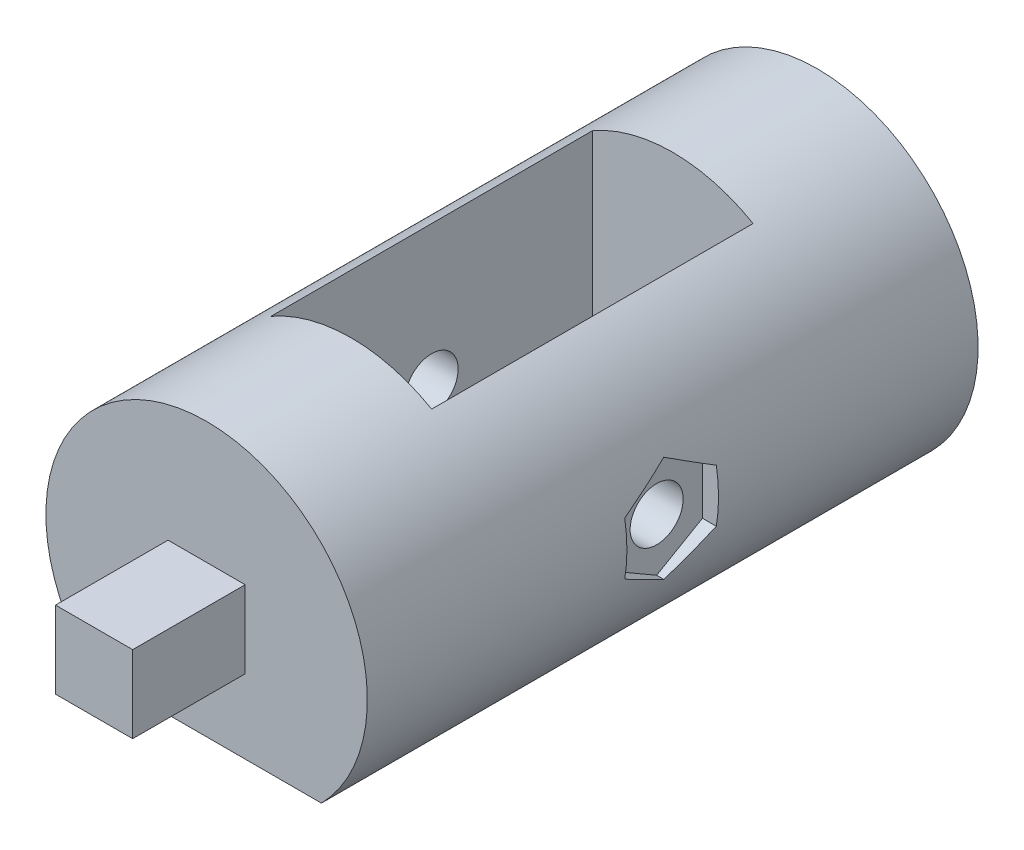
ISO-10303-21;
HEADER;
FILE_DESCRIPTION(('STEP AP214'),'2;1');
FILE_NAME('part.step','',(''),(''),'','','');
FILE_SCHEMA(('AUTOMOTIVE_DESIGN { 1 0 10303 214 1 1 1 1 }'));
ENDSEC;
DATA;
#1=APPLICATION_CONTEXT('core data for automotive mechanical design processes');
#2=APPLICATION_PROTOCOL_DEFINITION('international standard','automotive_design',2000,#1);
#3=PRODUCT_CONTEXT('',#1,'mechanical');
#4=PRODUCT('Part','Part','',(#3));
#5=PRODUCT_RELATED_PRODUCT_CATEGORY('part','',(#4));
#6=PRODUCT_DEFINITION_FORMATION('','',#4);
#7=PRODUCT_DEFINITION_CONTEXT('part definition',#1,'design');
#8=PRODUCT_DEFINITION('design','',#6,#7);
#9=PRODUCT_DEFINITION_SHAPE('','',#8);
#10=(LENGTH_UNIT() NAMED_UNIT(*) SI_UNIT(.MILLI.,.METRE.));
#11=(NAMED_UNIT(*) PLANE_ANGLE_UNIT() SI_UNIT($,.RADIAN.));
#12=(NAMED_UNIT(*) SI_UNIT($,.STERADIAN.) SOLID_ANGLE_UNIT());
#13=UNCERTAINTY_MEASURE_WITH_UNIT(LENGTH_MEASURE(1.E-05),#10,'distance_accuracy_value','');
#14=(GEOMETRIC_REPRESENTATION_CONTEXT(3) GLOBAL_UNCERTAINTY_ASSIGNED_CONTEXT((#13)) GLOBAL_UNIT_ASSIGNED_CONTEXT((#10,
#11,#12)) REPRESENTATION_CONTEXT('',''));
#15=CARTESIAN_POINT('',(0.,0.,0.));
#16=DIRECTION('',(0.,0.,1.));
#17=DIRECTION('',(1.,0.,0.));
#18=AXIS2_PLACEMENT_3D('',#15,#16,#17);
#19=CARTESIAN_POINT('',(0.,0.,38.));
#20=DIRECTION('',(0.,0.,-1.));
#21=DIRECTION('',(-1.,0.,0.));
#22=AXIS2_PLACEMENT_3D('',#19,#20,#21);
#23=CYLINDRICAL_SURFACE('',#22,10.);
#24=CARTESIAN_POINT('',(0.,0.,29.));
#25=DIRECTION('',(0.,0.,-1.));
#26=DIRECTION('',(-1.,0.,0.));
#27=AXIS2_PLACEMENT_3D('',#24,#25,#26);
#28=CIRCLE('',#27,10.);
#29=CARTESIAN_POINT('',(5.,8.66025403784439,29.));
#30=VERTEX_POINT('',#29);
#31=CARTESIAN_POINT('',(-5.,8.66025403784438,29.));
#32=VERTEX_POINT('',#31);
#33=EDGE_CURVE('E292',#30,#32,#28,.F.);
#34=ORIENTED_EDGE('',*,*,#33,.T.);
#35=DIRECTION('',(0.,0.,-1.));
#36=VECTOR('',#35,1.);
#37=CARTESIAN_POINT('',(-5.,8.66025403784438,38.));
#38=LINE('',#37,#36);
#39=CARTESIAN_POINT('',(-5.,8.66025403784438,9.));
#40=VERTEX_POINT('',#39);
#41=EDGE_CURVE('E316',#40,#32,#38,.F.);
#42=ORIENTED_EDGE('',*,*,#41,.F.);
#43=CARTESIAN_POINT('',(0.,0.,9.));
#44=DIRECTION('',(0.,0.,-1.));
#45=DIRECTION('',(-1.,0.,0.));
#46=AXIS2_PLACEMENT_3D('',#43,#44,#45);
#47=CIRCLE('',#46,10.);
#48=CARTESIAN_POINT('',(5.,8.66025403784439,9.));
#49=VERTEX_POINT('',#48);
#50=EDGE_CURVE('E286',#49,#40,#47,.F.);
#51=ORIENTED_EDGE('',*,*,#50,.F.);
#52=DIRECTION('',(0.,0.,-1.));
#53=VECTOR('',#52,1.);
#54=CARTESIAN_POINT('',(5.,8.66025403784439,38.));
#55=LINE('',#54,#53);
#56=EDGE_CURVE('E289',#49,#30,#55,.F.);
#57=ORIENTED_EDGE('',*,*,#56,.T.);
#58=EDGE_LOOP('',(#34,#42,#51,#57));
#59=FACE_BOUND('',#58,.T.);
#60=CARTESIAN_POINT('',(0.,0.,38.));
#61=DIRECTION('',(0.,0.,1.));
#62=DIRECTION('',(1.,0.,0.));
#63=AXIS2_PLACEMENT_3D('',#60,#61,#62);
#64=CIRCLE('',#63,10.);
#65=CARTESIAN_POINT('',(7.14142842854285,-7.,38.));
#66=VERTEX_POINT('',#65);
#67=CARTESIAN_POINT('',(-7.14142842854285,-7.,38.));
#68=VERTEX_POINT('',#67);
#69=EDGE_CURVE('E370',#66,#68,#64,.T.);
#70=ORIENTED_EDGE('',*,*,#69,.F.);
#71=DIRECTION('',(0.,0.,-1.));
#72=VECTOR('',#71,1.);
#73=CARTESIAN_POINT('',(7.14142842854285,-7.,38.));
#74=LINE('',#73,#72);
#75=CARTESIAN_POINT('',(7.14142842854285,-7.,0.));
#76=VERTEX_POINT('',#75);
#77=EDGE_CURVE('E11',#66,#76,#74,.T.);
#78=ORIENTED_EDGE('',*,*,#77,.T.);
#79=CARTESIAN_POINT('',(0.,0.,0.));
#80=DIRECTION('',(0.,0.,1.));
#81=DIRECTION('',(1.,0.,0.));
#82=AXIS2_PLACEMENT_3D('',#79,#80,#81);
#83=CIRCLE('',#82,10.);
#84=CARTESIAN_POINT('',(-7.14142842854285,-7.,0.));
#85=VERTEX_POINT('',#84);
#86=EDGE_CURVE('E369',#76,#85,#83,.T.);
#87=ORIENTED_EDGE('',*,*,#86,.T.);
#88=DIRECTION('',(0.,0.,-1.));
#89=VECTOR('',#88,1.);
#90=CARTESIAN_POINT('',(-7.14142842854285,-7.,38.));
#91=LINE('',#90,#89);
#92=EDGE_CURVE('E41',#85,#68,#91,.F.);
#93=ORIENTED_EDGE('',*,*,#92,.T.);
#94=EDGE_LOOP('',(#70,#78,#87,#93));
#95=FACE_BOUND('',#94,.T.);
#96=CARTESIAN_POINT('',(0.,0.,16.15));
#97=DIRECTION('',(0.,0.,-1.));
#98=DIRECTION('',(-1.,0.,0.));
#99=AXIS2_PLACEMENT_3D('',#96,#97,#98);
#100=CIRCLE('',#99,10.);
#101=CARTESIAN_POINT('',(9.86369606182186,-1.64544826719044,16.15));
#102=VERTEX_POINT('',#101);
#103=CARTESIAN_POINT('',(9.86369606182186,1.64544826719043,16.15));
#104=VERTEX_POINT('',#103);
#105=EDGE_CURVE('E249',#102,#104,#100,.F.);
#106=ORIENTED_EDGE('',*,*,#105,.F.);
#107=CARTESIAN_POINT('',(0.,0.,13.3));
#108=DIRECTION('',(0.,-0.866025403784439,-0.5));
#109=DIRECTION('',(0.,0.5,-0.866025403784439));
#110=AXIS2_PLACEMENT_3D('',#107,#108,#109);
#111=ELLIPSE('',#110,20.,10.);
#112=CARTESIAN_POINT('',(9.44298681562143,-3.29089653438087,19.));
#113=VERTEX_POINT('',#112);
#114=EDGE_CURVE('E251',#113,#102,#111,.F.);
#115=ORIENTED_EDGE('',*,*,#114,.F.);
#116=CARTESIAN_POINT('',(0.,0.,24.7));
#117=DIRECTION('',(0.,-0.866025403784439,0.5));
#118=DIRECTION('',(0.,-0.5,-0.866025403784439));
#119=AXIS2_PLACEMENT_3D('',#116,#117,#118);
#120=ELLIPSE('',#119,20.,10.);
#121=CARTESIAN_POINT('',(9.86369606182186,-1.64544826719043,21.85));
#122=VERTEX_POINT('',#121);
#123=EDGE_CURVE('E253',#122,#113,#120,.F.);
#124=ORIENTED_EDGE('',*,*,#123,.F.);
#125=CARTESIAN_POINT('',(0.,0.,21.85));
#126=DIRECTION('',(0.,0.,1.));
#127=DIRECTION('',(0.,-1.,0.));
#128=AXIS2_PLACEMENT_3D('',#125,#126,#127);
#129=CIRCLE('',#128,10.);
#130=CARTESIAN_POINT('',(9.86369606182186,1.64544826719043,21.85));
#131=VERTEX_POINT('',#130);
#132=EDGE_CURVE('E242',#131,#122,#129,.F.);
#133=ORIENTED_EDGE('',*,*,#132,.F.);
#134=CARTESIAN_POINT('',(0.,0.,24.7));
#135=DIRECTION('',(0.,0.866025403784438,0.5));
#136=DIRECTION('',(0.,0.5,-0.866025403784439));
#137=AXIS2_PLACEMENT_3D('',#134,#135,#136);
#138=ELLIPSE('',#137,20.,10.);
#139=CARTESIAN_POINT('',(9.44298681562143,3.29089653438086,19.));
#140=VERTEX_POINT('',#139);
#141=EDGE_CURVE('E244',#140,#131,#138,.F.);
#142=ORIENTED_EDGE('',*,*,#141,.F.);
#143=CARTESIAN_POINT('',(0.,0.,13.3));
#144=DIRECTION('',(0.,0.866025403784439,-0.5));
#145=DIRECTION('',(0.,-0.5,-0.866025403784439));
#146=AXIS2_PLACEMENT_3D('',#143,#144,#145);
#147=ELLIPSE('',#146,20.,10.);
#148=EDGE_CURVE('E247',#104,#140,#147,.F.);
#149=ORIENTED_EDGE('',*,*,#148,.F.);
#150=EDGE_LOOP('',(#106,#115,#124,#133,#142,#149));
#151=FACE_BOUND('',#150,.T.);
#152=CARTESIAN_POINT('',(0.,0.,16.15));
#153=DIRECTION('',(0.,0.,1.));
#154=DIRECTION('',(1.,0.,0.));
#155=AXIS2_PLACEMENT_3D('',#152,#153,#154);
#156=CIRCLE('',#155,10.);
#157=CARTESIAN_POINT('',(-9.86369606182186,-1.64544826719044,16.15));
#158=VERTEX_POINT('',#157);
#159=CARTESIAN_POINT('',(-9.86369606182186,1.64544826719043,16.15));
#160=VERTEX_POINT('',#159);
#161=EDGE_CURVE('E202',#158,#160,#156,.F.);
#162=ORIENTED_EDGE('',*,*,#161,.T.);
#163=CARTESIAN_POINT('',(0.,0.,13.3));
#164=DIRECTION('',(0.,-0.866025403784439,0.5));
#165=DIRECTION('',(0.,-0.5,-0.866025403784439));
#166=AXIS2_PLACEMENT_3D('',#163,#164,#165);
#167=ELLIPSE('',#166,20.,10.);
#168=CARTESIAN_POINT('',(-9.44298681562142,3.29089653438086,19.));
#169=VERTEX_POINT('',#168);
#170=EDGE_CURVE('E241',#160,#169,#167,.F.);
#171=ORIENTED_EDGE('',*,*,#170,.T.);
#172=CARTESIAN_POINT('',(0.,0.,24.7));
#173=DIRECTION('',(0.,-0.866025403784438,-0.5));
#174=DIRECTION('',(0.,0.5,-0.866025403784439));
#175=AXIS2_PLACEMENT_3D('',#172,#173,#174);
#176=ELLIPSE('',#175,20.,10.);
#177=CARTESIAN_POINT('',(-9.86369606182186,1.64544826719044,21.85));
#178=VERTEX_POINT('',#177);
#179=EDGE_CURVE('E431',#169,#178,#176,.F.);
#180=ORIENTED_EDGE('',*,*,#179,.T.);
#181=CARTESIAN_POINT('',(0.,0.,21.85));
#182=DIRECTION('',(0.,0.,-1.));
#183=DIRECTION('',(0.,1.,0.));
#184=AXIS2_PLACEMENT_3D('',#181,#182,#183);
#185=CIRCLE('',#184,10.);
#186=CARTESIAN_POINT('',(-9.86369606182186,-1.64544826719043,21.85));
#187=VERTEX_POINT('',#186);
#188=EDGE_CURVE('E433',#178,#187,#185,.F.);
#189=ORIENTED_EDGE('',*,*,#188,.T.);
#190=CARTESIAN_POINT('',(0.,0.,24.7));
#191=DIRECTION('',(0.,0.866025403784439,-0.5));
#192=DIRECTION('',(0.,-0.5,-0.866025403784439));
#193=AXIS2_PLACEMENT_3D('',#190,#191,#192);
#194=ELLIPSE('',#193,20.,10.);
#195=CARTESIAN_POINT('',(-9.44298681562143,-3.29089653438087,19.));
#196=VERTEX_POINT('',#195);
#197=EDGE_CURVE('E435',#187,#196,#194,.F.);
#198=ORIENTED_EDGE('',*,*,#197,.T.);
#199=CARTESIAN_POINT('',(0.,0.,13.3));
#200=DIRECTION('',(0.,0.866025403784439,0.5));
#201=DIRECTION('',(0.,0.5,-0.866025403784439));
#202=AXIS2_PLACEMENT_3D('',#199,#200,#201);
#203=ELLIPSE('',#202,20.,10.);
#204=EDGE_CURVE('E199',#196,#158,#203,.F.);
#205=ORIENTED_EDGE('',*,*,#204,.T.);
#206=EDGE_LOOP('',(#162,#171,#180,#189,#198,#205));
#207=FACE_BOUND('',#206,.T.);
#208=ADVANCED_FACE('F33',(#59,#95,#151,#207),#23,.T.);
#209=CARTESIAN_POINT('',(10.,0.,19.));
#210=DIRECTION('',(-1.,0.,0.));
#211=DIRECTION('',(0.,-1.,0.));
#212=AXIS2_PLACEMENT_3D('',#209,#210,#211);
#213=CYLINDRICAL_SURFACE('',#212,1.65);
#214=CARTESIAN_POINT('',(-5.,0.,19.));
#215=DIRECTION('',(-1.,0.,0.));
#216=DIRECTION('',(0.,0.,1.));
#217=AXIS2_PLACEMENT_3D('',#214,#215,#216);
#218=CIRCLE('',#217,1.65);
#219=CARTESIAN_POINT('',(-5.,0.,20.65));
#220=VERTEX_POINT('',#219);
#221=EDGE_CURVE('E287',#220,#220,#218,.T.);
#222=ORIENTED_EDGE('',*,*,#221,.F.);
#223=EDGE_LOOP('',(#222));
#224=FACE_BOUND('',#223,.T.);
#225=CARTESIAN_POINT('',(-9.,0.,19.));
#226=DIRECTION('',(-1.,0.,0.));
#227=DIRECTION('',(0.,-1.,0.));
#228=AXIS2_PLACEMENT_3D('',#225,#226,#227);
#229=CIRCLE('',#228,1.65);
#230=CARTESIAN_POINT('',(-9.,-1.65,19.));
#231=VERTEX_POINT('',#230);
#232=EDGE_CURVE('E36',#231,#231,#229,.F.);
#233=ORIENTED_EDGE('',*,*,#232,.F.);
#234=EDGE_LOOP('',(#233));
#235=FACE_BOUND('',#234,.T.);
#236=ADVANCED_FACE('F398',(#224,#235),#213,.F.);
#237=CARTESIAN_POINT('',(-10.,-7.,59.1896201004171));
#238=DIRECTION('',(0.,1.,0.));
#239=DIRECTION('',(-1.,0.,0.));
#240=AXIS2_PLACEMENT_3D('',#237,#238,#239);
#241=PLANE('',#240);
#242=DIRECTION('',(1.,0.,0.));
#243=VECTOR('',#242,1.);
#244=CARTESIAN_POINT('',(-10.,-7.,38.));
#245=LINE('',#244,#243);
#246=EDGE_CURVE('E321',#68,#66,#245,.T.);
#247=ORIENTED_EDGE('',*,*,#246,.F.);
#248=ORIENTED_EDGE('',*,*,#92,.F.);
#249=DIRECTION('',(1.,0.,0.));
#250=VECTOR('',#249,1.);
#251=CARTESIAN_POINT('',(-10.,-7.,0.));
#252=LINE('',#251,#250);
#253=EDGE_CURVE('E319',#85,#76,#252,.T.);
#254=ORIENTED_EDGE('',*,*,#253,.T.);
#255=ORIENTED_EDGE('',*,*,#77,.F.);
#256=EDGE_LOOP('',(#247,#248,#254,#255));
#257=FACE_BOUND('',#256,.T.);
#258=DIRECTION('',(1.,0.,0.));
#259=VECTOR('',#258,1.);
#260=CARTESIAN_POINT('',(-5.,-7.,29.));
#261=LINE('',#260,#259);
#262=CARTESIAN_POINT('',(-5.,-7.,29.));
#263=VERTEX_POINT('',#262);
#264=CARTESIAN_POINT('',(5.,-7.,29.));
#265=VERTEX_POINT('',#264);
#266=EDGE_CURVE('E295',#263,#265,#261,.T.);
#267=ORIENTED_EDGE('',*,*,#266,.T.);
#268=DIRECTION('',(0.,0.,-1.));
#269=VECTOR('',#268,1.);
#270=CARTESIAN_POINT('',(5.,-7.,29.));
#271=LINE('',#270,#269);
#272=CARTESIAN_POINT('',(5.,-7.,9.));
#273=VERTEX_POINT('',#272);
#274=EDGE_CURVE('E298',#265,#273,#271,.T.);
#275=ORIENTED_EDGE('',*,*,#274,.T.);
#276=DIRECTION('',(1.,0.,0.));
#277=VECTOR('',#276,1.);
#278=CARTESIAN_POINT('',(-5.,-7.,9.));
#279=LINE('',#278,#277);
#280=CARTESIAN_POINT('',(-5.,-7.,9.));
#281=VERTEX_POINT('',#280);
#282=EDGE_CURVE('E301',#281,#273,#279,.T.);
#283=ORIENTED_EDGE('',*,*,#282,.F.);
#284=DIRECTION('',(0.,0.,-1.));
#285=VECTOR('',#284,1.);
#286=CARTESIAN_POINT('',(-5.,-7.,29.));
#287=LINE('',#286,#285);
#288=EDGE_CURVE('E304',#263,#281,#287,.T.);
#289=ORIENTED_EDGE('',*,*,#288,.F.);
#290=EDGE_LOOP('',(#267,#275,#283,#289));
#291=FACE_BOUND('',#290,.T.);
#292=ADVANCED_FACE('F407',(#257,#291),#241,.F.);
#293=CARTESIAN_POINT('',(0.,0.,0.));
#294=DIRECTION('',(0.,0.,1.));
#295=DIRECTION('',(1.,0.,0.));
#296=AXIS2_PLACEMENT_3D('',#293,#294,#295);
#297=PLANE('',#296);
#298=ORIENTED_EDGE('',*,*,#86,.F.);
#299=ORIENTED_EDGE('',*,*,#253,.F.);
#300=EDGE_LOOP('',(#298,#299));
#301=FACE_BOUND('',#300,.T.);
#302=DIRECTION('',(-1.,0.,0.));
#303=VECTOR('',#302,1.);
#304=CARTESIAN_POINT('',(0.,1.5,0.));
#305=LINE('',#304,#303);
#306=CARTESIAN_POINT('',(2.18460522749535,1.5,0.));
#307=VERTEX_POINT('',#306);
#308=CARTESIAN_POINT('',(-2.18460522749535,1.5,0.));
#309=VERTEX_POINT('',#308);
#310=EDGE_CURVE('E324',#307,#309,#305,.T.);
#311=ORIENTED_EDGE('',*,*,#310,.T.);
#312=CARTESIAN_POINT('',(0.,0.,0.));
#313=DIRECTION('',(0.,0.,-1.));
#314=DIRECTION('',(-1.,0.,0.));
#315=AXIS2_PLACEMENT_3D('',#312,#313,#314);
#316=CIRCLE('',#315,2.65);
#317=EDGE_CURVE('E328',#307,#309,#316,.T.);
#318=ORIENTED_EDGE('',*,*,#317,.F.);
#319=EDGE_LOOP('',(#311,#318));
#320=FACE_BOUND('',#319,.T.);
#321=ADVANCED_FACE('F607',(#301,#320),#297,.F.);
#322=CARTESIAN_POINT('',(0.,0.,38.));
#323=DIRECTION('',(0.,0.,1.));
#324=DIRECTION('',(1.,0.,0.));
#325=AXIS2_PLACEMENT_3D('',#322,#323,#324);
#326=PLANE('',#325);
#327=ORIENTED_EDGE('',*,*,#246,.T.);
#328=ORIENTED_EDGE('',*,*,#69,.T.);
#329=EDGE_LOOP('',(#327,#328));
#330=FACE_BOUND('',#329,.T.);
#331=DIRECTION('',(1.,0.,0.));
#332=VECTOR('',#331,1.);
#333=CARTESIAN_POINT('',(-2.4,-2.4,38.));
#334=LINE('',#333,#332);
#335=CARTESIAN_POINT('',(-2.4,-2.4,38.));
#336=VERTEX_POINT('',#335);
#337=CARTESIAN_POINT('',(2.4,-2.4,38.));
#338=VERTEX_POINT('',#337);
#339=EDGE_CURVE('E354',#336,#338,#334,.T.);
#340=ORIENTED_EDGE('',*,*,#339,.F.);
#341=DIRECTION('',(0.,-1.,0.));
#342=VECTOR('',#341,1.);
#343=CARTESIAN_POINT('',(-2.4,2.4,38.));
#344=LINE('',#343,#342);
#345=CARTESIAN_POINT('',(-2.4,2.4,38.));
#346=VERTEX_POINT('',#345);
#347=EDGE_CURVE('E338',#346,#336,#344,.T.);
#348=ORIENTED_EDGE('',*,*,#347,.F.);
#349=DIRECTION('',(-1.,0.,0.));
#350=VECTOR('',#349,1.);
#351=CARTESIAN_POINT('',(-2.4,2.4,38.));
#352=LINE('',#351,#350);
#353=CARTESIAN_POINT('',(2.4,2.4,38.));
#354=VERTEX_POINT('',#353);
#355=EDGE_CURVE('E345',#354,#346,#352,.T.);
#356=ORIENTED_EDGE('',*,*,#355,.F.);
#357=DIRECTION('',(0.,1.,0.));
#358=VECTOR('',#357,1.);
#359=CARTESIAN_POINT('',(2.4,2.4,38.));
#360=LINE('',#359,#358);
#361=EDGE_CURVE('E356',#338,#354,#360,.T.);
#362=ORIENTED_EDGE('',*,*,#361,.F.);
#363=EDGE_LOOP('',(#340,#348,#356,#362));
#364=FACE_BOUND('',#363,.T.);
#365=ADVANCED_FACE('F615',(#330,#364),#326,.T.);
#366=CARTESIAN_POINT('',(-2.4,2.4,45.));
#367=DIRECTION('',(1.,0.,0.));
#368=DIRECTION('',(0.,1.,0.));
#369=AXIS2_PLACEMENT_3D('',#366,#367,#368);
#370=PLANE('',#369);
#371=ORIENTED_EDGE('',*,*,#347,.T.);
#372=DIRECTION('',(0.,0.,-1.));
#373=VECTOR('',#372,1.);
#374=CARTESIAN_POINT('',(-2.4,-2.4,45.));
#375=LINE('',#374,#373);
#376=CARTESIAN_POINT('',(-2.4,-2.4,45.));
#377=VERTEX_POINT('',#376);
#378=EDGE_CURVE('E367',#377,#336,#375,.T.);
#379=ORIENTED_EDGE('',*,*,#378,.F.);
#380=DIRECTION('',(0.,-1.,0.));
#381=VECTOR('',#380,1.);
#382=CARTESIAN_POINT('',(-2.4,2.4,45.));
#383=LINE('',#382,#381);
#384=CARTESIAN_POINT('',(-2.4,2.4,45.));
#385=VERTEX_POINT('',#384);
#386=EDGE_CURVE('E341',#385,#377,#383,.T.);
#387=ORIENTED_EDGE('',*,*,#386,.F.);
#388=DIRECTION('',(0.,0.,-1.));
#389=VECTOR('',#388,1.);
#390=CARTESIAN_POINT('',(-2.4,2.4,45.));
#391=LINE('',#390,#389);
#392=EDGE_CURVE('E351',#385,#346,#391,.T.);
#393=ORIENTED_EDGE('',*,*,#392,.T.);
#394=EDGE_LOOP('',(#371,#379,#387,#393));
#395=FACE_BOUND('',#394,.T.);
#396=ADVANCED_FACE('F620',(#395),#370,.F.);
#397=CARTESIAN_POINT('',(-2.4,-2.4,45.));
#398=DIRECTION('',(0.,1.,0.));
#399=DIRECTION('',(0.,0.,1.));
#400=AXIS2_PLACEMENT_3D('',#397,#398,#399);
#401=PLANE('',#400);
#402=ORIENTED_EDGE('',*,*,#339,.T.);
#403=DIRECTION('',(0.,0.,-1.));
#404=VECTOR('',#403,1.);
#405=CARTESIAN_POINT('',(2.4,-2.4,45.));
#406=LINE('',#405,#404);
#407=CARTESIAN_POINT('',(2.4,-2.4,45.));
#408=VERTEX_POINT('',#407);
#409=EDGE_CURVE('E364',#408,#338,#406,.T.);
#410=ORIENTED_EDGE('',*,*,#409,.F.);
#411=DIRECTION('',(1.,0.,0.));
#412=VECTOR('',#411,1.);
#413=CARTESIAN_POINT('',(-2.4,-2.4,45.));
#414=LINE('',#413,#412);
#415=EDGE_CURVE('E344',#377,#408,#414,.T.);
#416=ORIENTED_EDGE('',*,*,#415,.F.);
#417=ORIENTED_EDGE('',*,*,#378,.T.);
#418=EDGE_LOOP('',(#402,#410,#416,#417));
#419=FACE_BOUND('',#418,.T.);
#420=ADVANCED_FACE('F687',(#419),#401,.F.);
#421=CARTESIAN_POINT('',(2.4,2.4,45.));
#422=DIRECTION('',(-1.,0.,0.));
#423=DIRECTION('',(0.,-1.,0.));
#424=AXIS2_PLACEMENT_3D('',#421,#422,#423);
#425=PLANE('',#424);
#426=ORIENTED_EDGE('',*,*,#361,.T.);
#427=DIRECTION('',(0.,0.,-1.));
#428=VECTOR('',#427,1.);
#429=CARTESIAN_POINT('',(2.4,2.4,45.));
#430=LINE('',#429,#428);
#431=CARTESIAN_POINT('',(2.4,2.4,45.));
#432=VERTEX_POINT('',#431);
#433=EDGE_CURVE('E362',#432,#354,#430,.T.);
#434=ORIENTED_EDGE('',*,*,#433,.F.);
#435=DIRECTION('',(0.,1.,0.));
#436=VECTOR('',#435,1.);
#437=CARTESIAN_POINT('',(2.4,2.4,45.));
#438=LINE('',#437,#436);
#439=EDGE_CURVE('E347',#408,#432,#438,.T.);
#440=ORIENTED_EDGE('',*,*,#439,.F.);
#441=ORIENTED_EDGE('',*,*,#409,.T.);
#442=EDGE_LOOP('',(#426,#434,#440,#441));
#443=FACE_BOUND('',#442,.T.);
#444=ADVANCED_FACE('F677',(#443),#425,.F.);
#445=CARTESIAN_POINT('',(-2.4,2.4,45.));
#446=DIRECTION('',(0.,-1.,0.));
#447=DIRECTION('',(1.,0.,0.));
#448=AXIS2_PLACEMENT_3D('',#445,#446,#447);
#449=PLANE('',#448);
#450=ORIENTED_EDGE('',*,*,#355,.T.);
#451=ORIENTED_EDGE('',*,*,#392,.F.);
#452=DIRECTION('',(-1.,0.,0.));
#453=VECTOR('',#452,1.);
#454=CARTESIAN_POINT('',(-2.4,2.4,45.));
#455=LINE('',#454,#453);
#456=EDGE_CURVE('E349',#432,#385,#455,.T.);
#457=ORIENTED_EDGE('',*,*,#456,.F.);
#458=ORIENTED_EDGE('',*,*,#433,.T.);
#459=EDGE_LOOP('',(#450,#451,#457,#458));
#460=FACE_BOUND('',#459,.T.);
#461=ADVANCED_FACE('F667',(#460),#449,.F.);
#462=CARTESIAN_POINT('',(0.,0.,45.));
#463=DIRECTION('',(0.,0.,1.));
#464=DIRECTION('',(1.,0.,0.));
#465=AXIS2_PLACEMENT_3D('',#462,#463,#464);
#466=PLANE('',#465);
#467=ORIENTED_EDGE('',*,*,#386,.T.);
#468=ORIENTED_EDGE('',*,*,#415,.T.);
#469=ORIENTED_EDGE('',*,*,#439,.T.);
#470=ORIENTED_EDGE('',*,*,#456,.T.);
#471=EDGE_LOOP('',(#467,#468,#469,#470));
#472=FACE_BOUND('',#471,.T.);
#473=ADVANCED_FACE('F658',(#472),#466,.T.);
#474=CARTESIAN_POINT('',(0.,1.5,7.));
#475=DIRECTION('',(0.,-1.,0.));
#476=DIRECTION('',(0.,0.,-1.));
#477=AXIS2_PLACEMENT_3D('',#474,#475,#476);
#478=PLANE('',#477);
#479=ORIENTED_EDGE('',*,*,#310,.F.);
#480=DIRECTION('',(0.,0.,-1.));
#481=VECTOR('',#480,1.);
#482=CARTESIAN_POINT('',(2.18460522749535,1.5,7.));
#483=LINE('',#482,#481);
#484=CARTESIAN_POINT('',(2.18460522749535,1.5,7.));
#485=VERTEX_POINT('',#484);
#486=EDGE_CURVE('E331',#485,#307,#483,.T.);
#487=ORIENTED_EDGE('',*,*,#486,.F.);
#488=DIRECTION('',(-1.,0.,0.));
#489=VECTOR('',#488,1.);
#490=CARTESIAN_POINT('',(0.,1.5,7.));
#491=LINE('',#490,#489);
#492=CARTESIAN_POINT('',(-2.18460522749535,1.5,7.));
#493=VERTEX_POINT('',#492);
#494=EDGE_CURVE('E325',#485,#493,#491,.T.);
#495=ORIENTED_EDGE('',*,*,#494,.T.);
#496=DIRECTION('',(0.,0.,-1.));
#497=VECTOR('',#496,1.);
#498=CARTESIAN_POINT('',(-2.18460522749535,1.5,7.));
#499=LINE('',#498,#497);
#500=EDGE_CURVE('E336',#493,#309,#499,.T.);
#501=ORIENTED_EDGE('',*,*,#500,.T.);
#502=EDGE_LOOP('',(#479,#487,#495,#501));
#503=FACE_BOUND('',#502,.T.);
#504=ADVANCED_FACE('F649',(#503),#478,.T.);
#505=CARTESIAN_POINT('',(0.,0.,7.));
#506=DIRECTION('',(0.,0.,-1.));
#507=DIRECTION('',(-1.,0.,0.));
#508=AXIS2_PLACEMENT_3D('',#505,#506,#507);
#509=CYLINDRICAL_SURFACE('',#508,2.65);
#510=ORIENTED_EDGE('',*,*,#317,.T.);
#511=ORIENTED_EDGE('',*,*,#500,.F.);
#512=CARTESIAN_POINT('',(0.,0.,7.));
#513=DIRECTION('',(0.,0.,-1.));
#514=DIRECTION('',(-1.,0.,0.));
#515=AXIS2_PLACEMENT_3D('',#512,#513,#514);
#516=CIRCLE('',#515,2.65);
#517=EDGE_CURVE('E327',#485,#493,#516,.T.);
#518=ORIENTED_EDGE('',*,*,#517,.F.);
#519=ORIENTED_EDGE('',*,*,#486,.T.);
#520=EDGE_LOOP('',(#510,#511,#518,#519));
#521=FACE_BOUND('',#520,.T.);
#522=ADVANCED_FACE('F639',(#521),#509,.F.);
#523=CARTESIAN_POINT('',(0.,0.,7.));
#524=DIRECTION('',(0.,0.,-1.));
#525=DIRECTION('',(-1.,0.,0.));
#526=AXIS2_PLACEMENT_3D('',#523,#524,#525);
#527=PLANE('',#526);
#528=ORIENTED_EDGE('',*,*,#494,.F.);
#529=ORIENTED_EDGE('',*,*,#517,.T.);
#530=EDGE_LOOP('',(#528,#529));
#531=FACE_BOUND('',#530,.T.);
#532=ADVANCED_FACE('F597',(#531),#527,.T.);
#533=CARTESIAN_POINT('',(-5.,10.001,29.));
#534=DIRECTION('',(0.,0.,-1.));
#535=DIRECTION('',(-1.,0.,0.));
#536=AXIS2_PLACEMENT_3D('',#533,#534,#535);
#537=PLANE('',#536);
#538=DIRECTION('',(0.,-1.,0.));
#539=VECTOR('',#538,1.);
#540=CARTESIAN_POINT('',(5.,10.001,29.));
#541=LINE('',#540,#539);
#542=EDGE_CURVE('E314',#30,#265,#541,.T.);
#543=ORIENTED_EDGE('',*,*,#542,.T.);
#544=ORIENTED_EDGE('',*,*,#266,.F.);
#545=DIRECTION('',(0.,-1.,0.));
#546=VECTOR('',#545,1.);
#547=CARTESIAN_POINT('',(-5.,10.001,29.));
#548=LINE('',#547,#546);
#549=EDGE_CURVE('E307',#32,#263,#548,.T.);
#550=ORIENTED_EDGE('',*,*,#549,.F.);
#551=ORIENTED_EDGE('',*,*,#33,.F.);
#552=EDGE_LOOP('',(#543,#544,#550,#551));
#553=FACE_BOUND('',#552,.T.);
#554=ADVANCED_FACE('F580',(#553),#537,.T.);
#555=CARTESIAN_POINT('',(5.,10.001,29.));
#556=DIRECTION('',(-1.,0.,0.));
#557=DIRECTION('',(0.,0.,1.));
#558=AXIS2_PLACEMENT_3D('',#555,#556,#557);
#559=PLANE('',#558);
#560=CARTESIAN_POINT('',(5.,0.,19.));
#561=DIRECTION('',(-1.,0.,0.));
#562=DIRECTION('',(0.,0.,1.));
#563=AXIS2_PLACEMENT_3D('',#560,#561,#562);
#564=CIRCLE('',#563,1.65);
#565=CARTESIAN_POINT('',(5.,0.,20.65));
#566=VERTEX_POINT('',#565);
#567=EDGE_CURVE('E283',#566,#566,#564,.T.);
#568=ORIENTED_EDGE('',*,*,#567,.F.);
#569=EDGE_LOOP('',(#568));
#570=FACE_BOUND('',#569,.T.);
#571=DIRECTION('',(0.,-1.,0.));
#572=VECTOR('',#571,1.);
#573=CARTESIAN_POINT('',(5.,10.001,9.));
#574=LINE('',#573,#572);
#575=EDGE_CURVE('E312',#49,#273,#574,.T.);
#576=ORIENTED_EDGE('',*,*,#575,.T.);
#577=ORIENTED_EDGE('',*,*,#274,.F.);
#578=ORIENTED_EDGE('',*,*,#542,.F.);
#579=ORIENTED_EDGE('',*,*,#56,.F.);
#580=EDGE_LOOP('',(#576,#577,#578,#579));
#581=FACE_BOUND('',#580,.T.);
#582=ADVANCED_FACE('F575',(#570,#581),#559,.T.);
#583=CARTESIAN_POINT('',(-5.,10.001,9.));
#584=DIRECTION('',(0.,0.,-1.));
#585=DIRECTION('',(-1.,0.,0.));
#586=AXIS2_PLACEMENT_3D('',#583,#584,#585);
#587=PLANE('',#586);
#588=ORIENTED_EDGE('',*,*,#50,.T.);
#589=DIRECTION('',(0.,-1.,0.));
#590=VECTOR('',#589,1.);
#591=CARTESIAN_POINT('',(-5.,10.001,9.));
#592=LINE('',#591,#590);
#593=EDGE_CURVE('E310',#40,#281,#592,.T.);
#594=ORIENTED_EDGE('',*,*,#593,.T.);
#595=ORIENTED_EDGE('',*,*,#282,.T.);
#596=ORIENTED_EDGE('',*,*,#575,.F.);
#597=EDGE_LOOP('',(#588,#594,#595,#596));
#598=FACE_BOUND('',#597,.T.);
#599=ADVANCED_FACE('F567',(#598),#587,.F.);
#600=CARTESIAN_POINT('',(-5.,10.001,29.));
#601=DIRECTION('',(-1.,0.,0.));
#602=DIRECTION('',(0.,0.,1.));
#603=AXIS2_PLACEMENT_3D('',#600,#601,#602);
#604=PLANE('',#603);
#605=ORIENTED_EDGE('',*,*,#221,.T.);
#606=EDGE_LOOP('',(#605));
#607=FACE_BOUND('',#606,.T.);
#608=ORIENTED_EDGE('',*,*,#41,.T.);
#609=ORIENTED_EDGE('',*,*,#549,.T.);
#610=ORIENTED_EDGE('',*,*,#288,.T.);
#611=ORIENTED_EDGE('',*,*,#593,.F.);
#612=EDGE_LOOP('',(#608,#609,#610,#611));
#613=FACE_BOUND('',#612,.T.);
#614=ADVANCED_FACE('F396',(#607,#613),#604,.F.);
#615=CARTESIAN_POINT('',(9.,0.,19.));
#616=DIRECTION('',(-1.,0.,0.));
#617=DIRECTION('',(0.,-1.,0.));
#618=AXIS2_PLACEMENT_3D('',#615,#616,#617);
#619=CIRCLE('',#618,1.65);
#620=CARTESIAN_POINT('',(9.,-1.65,19.));
#621=VERTEX_POINT('',#620);
#622=EDGE_CURVE('E282',#621,#621,#619,.F.);
#623=ORIENTED_EDGE('',*,*,#622,.T.);
#624=EDGE_LOOP('',(#623));
#625=FACE_BOUND('',#624,.T.);
#626=ORIENTED_EDGE('',*,*,#567,.T.);
#627=EDGE_LOOP('',(#626));
#628=FACE_BOUND('',#627,.T.);
#629=ADVANCED_FACE('F381',(#625,#628),#213,.F.);
#630=CARTESIAN_POINT('',(9.,0.,0.));
#631=DIRECTION('',(-1.,0.,0.));
#632=DIRECTION('',(0.,-1.,0.));
#633=AXIS2_PLACEMENT_3D('',#630,#631,#632);
#634=PLANE('',#633);
#635=DIRECTION('',(0.,-0.5,0.866025403784439));
#636=VECTOR('',#635,1.);
#637=CARTESIAN_POINT('',(9.,-1.64544826719044,16.15));
#638=LINE('',#637,#636);
#639=CARTESIAN_POINT('',(9.,-1.64544826719044,16.15));
#640=VERTEX_POINT('',#639);
#641=CARTESIAN_POINT('',(9.,-3.29089653438087,19.));
#642=VERTEX_POINT('',#641);
#643=EDGE_CURVE('E254',#640,#642,#638,.T.);
#644=ORIENTED_EDGE('',*,*,#643,.F.);
#645=DIRECTION('',(0.,-1.,0.));
#646=VECTOR('',#645,1.);
#647=CARTESIAN_POINT('',(9.,1.64544826719043,16.15));
#648=LINE('',#647,#646);
#649=CARTESIAN_POINT('',(9.,1.64544826719043,16.15));
#650=VERTEX_POINT('',#649);
#651=EDGE_CURVE('E268',#650,#640,#648,.T.);
#652=ORIENTED_EDGE('',*,*,#651,.F.);
#653=DIRECTION('',(0.,-0.5,-0.866025403784439));
#654=VECTOR('',#653,1.);
#655=CARTESIAN_POINT('',(9.,3.29089653438086,19.));
#656=LINE('',#655,#654);
#657=CARTESIAN_POINT('',(9.,3.29089653438086,19.));
#658=VERTEX_POINT('',#657);
#659=EDGE_CURVE('E265',#658,#650,#656,.T.);
#660=ORIENTED_EDGE('',*,*,#659,.F.);
#661=DIRECTION('',(0.,0.5,-0.866025403784438));
#662=VECTOR('',#661,1.);
#663=CARTESIAN_POINT('',(9.,1.64544826719043,21.85));
#664=LINE('',#663,#662);
#665=CARTESIAN_POINT('',(9.,1.64544826719043,21.85));
#666=VERTEX_POINT('',#665);
#667=EDGE_CURVE('E262',#666,#658,#664,.T.);
#668=ORIENTED_EDGE('',*,*,#667,.F.);
#669=DIRECTION('',(0.,1.,0.));
#670=VECTOR('',#669,1.);
#671=CARTESIAN_POINT('',(9.,-1.64544826719044,21.85));
#672=LINE('',#671,#670);
#673=CARTESIAN_POINT('',(9.,-1.64544826719044,21.85));
#674=VERTEX_POINT('',#673);
#675=EDGE_CURVE('E259',#674,#666,#672,.T.);
#676=ORIENTED_EDGE('',*,*,#675,.F.);
#677=DIRECTION('',(0.,0.5,0.866025403784439));
#678=VECTOR('',#677,1.);
#679=CARTESIAN_POINT('',(9.,-3.29089653438087,19.));
#680=LINE('',#679,#678);
#681=EDGE_CURVE('E257',#642,#674,#680,.T.);
#682=ORIENTED_EDGE('',*,*,#681,.F.);
#683=EDGE_LOOP('',(#644,#652,#660,#668,#676,#682));
#684=FACE_BOUND('',#683,.T.);
#685=ORIENTED_EDGE('',*,*,#622,.F.);
#686=EDGE_LOOP('',(#685));
#687=FACE_BOUND('',#686,.T.);
#688=ADVANCED_FACE('F384',(#684,#687),#634,.F.);
#689=CARTESIAN_POINT('',(10.001,-1.64544826719044,16.15));
#690=DIRECTION('',(0.,-0.866025403784439,-0.5));
#691=DIRECTION('',(0.,0.5,-0.866025403784439));
#692=AXIS2_PLACEMENT_3D('',#689,#690,#691);
#693=PLANE('',#692);
#694=ORIENTED_EDGE('',*,*,#114,.T.);
#695=DIRECTION('',(-1.,0.,0.));
#696=VECTOR('',#695,1.);
#697=CARTESIAN_POINT('',(10.001,-1.64544826719044,16.15));
#698=LINE('',#697,#696);
#699=EDGE_CURVE('E245',#102,#640,#698,.T.);
#700=ORIENTED_EDGE('',*,*,#699,.T.);
#701=ORIENTED_EDGE('',*,*,#643,.T.);
#702=DIRECTION('',(-1.,0.,0.));
#703=VECTOR('',#702,1.);
#704=CARTESIAN_POINT('',(10.001,-3.29089653438087,19.));
#705=LINE('',#704,#703);
#706=EDGE_CURVE('E271',#113,#642,#705,.T.);
#707=ORIENTED_EDGE('',*,*,#706,.F.);
#708=EDGE_LOOP('',(#694,#700,#701,#707));
#709=FACE_BOUND('',#708,.T.);
#710=ADVANCED_FACE('F386',(#709),#693,.F.);
#711=CARTESIAN_POINT('',(10.001,1.64544826719043,16.15));
#712=DIRECTION('',(0.,0.,-1.));
#713=DIRECTION('',(-1.,0.,0.));
#714=AXIS2_PLACEMENT_3D('',#711,#712,#713);
#715=PLANE('',#714);
#716=ORIENTED_EDGE('',*,*,#105,.T.);
#717=DIRECTION('',(-1.,0.,0.));
#718=VECTOR('',#717,1.);
#719=CARTESIAN_POINT('',(10.001,1.64544826719043,16.15));
#720=LINE('',#719,#718);
#721=EDGE_CURVE('E273',#104,#650,#720,.T.);
#722=ORIENTED_EDGE('',*,*,#721,.T.);
#723=ORIENTED_EDGE('',*,*,#651,.T.);
#724=ORIENTED_EDGE('',*,*,#699,.F.);
#725=EDGE_LOOP('',(#716,#722,#723,#724));
#726=FACE_BOUND('',#725,.T.);
#727=ADVANCED_FACE('F393',(#726),#715,.F.);
#728=CARTESIAN_POINT('',(10.001,3.29089653438086,19.));
#729=DIRECTION('',(0.,0.866025403784439,-0.5));
#730=DIRECTION('',(0.,0.5,0.866025403784439));
#731=AXIS2_PLACEMENT_3D('',#728,#729,#730);
#732=PLANE('',#731);
#733=ORIENTED_EDGE('',*,*,#148,.T.);
#734=DIRECTION('',(-1.,0.,0.));
#735=VECTOR('',#734,1.);
#736=CARTESIAN_POINT('',(10.001,3.29089653438086,19.));
#737=LINE('',#736,#735);
#738=EDGE_CURVE('E275',#140,#658,#737,.T.);
#739=ORIENTED_EDGE('',*,*,#738,.T.);
#740=ORIENTED_EDGE('',*,*,#659,.T.);
#741=ORIENTED_EDGE('',*,*,#721,.F.);
#742=EDGE_LOOP('',(#733,#739,#740,#741));
#743=FACE_BOUND('',#742,.T.);
#744=ADVANCED_FACE('F524',(#743),#732,.F.);
#745=CARTESIAN_POINT('',(10.001,1.64544826719043,21.85));
#746=DIRECTION('',(0.,0.866025403784438,0.5));
#747=DIRECTION('',(0.,-0.5,0.866025403784439));
#748=AXIS2_PLACEMENT_3D('',#745,#746,#747);
#749=PLANE('',#748);
#750=ORIENTED_EDGE('',*,*,#141,.T.);
#751=DIRECTION('',(-1.,0.,0.));
#752=VECTOR('',#751,1.);
#753=CARTESIAN_POINT('',(10.001,1.64544826719043,21.85));
#754=LINE('',#753,#752);
#755=EDGE_CURVE('E277',#131,#666,#754,.T.);
#756=ORIENTED_EDGE('',*,*,#755,.T.);
#757=ORIENTED_EDGE('',*,*,#667,.T.);
#758=ORIENTED_EDGE('',*,*,#738,.F.);
#759=EDGE_LOOP('',(#750,#756,#757,#758));
#760=FACE_BOUND('',#759,.T.);
#761=ADVANCED_FACE('F514',(#760),#749,.F.);
#762=CARTESIAN_POINT('',(10.001,-1.64544826719044,21.85));
#763=DIRECTION('',(0.,0.,1.));
#764=DIRECTION('',(0.,-1.,0.));
#765=AXIS2_PLACEMENT_3D('',#762,#763,#764);
#766=PLANE('',#765);
#767=ORIENTED_EDGE('',*,*,#132,.T.);
#768=DIRECTION('',(-1.,0.,0.));
#769=VECTOR('',#768,1.);
#770=CARTESIAN_POINT('',(10.001,-1.64544826719044,21.85));
#771=LINE('',#770,#769);
#772=EDGE_CURVE('E57',#122,#674,#771,.T.);
#773=ORIENTED_EDGE('',*,*,#772,.T.);
#774=ORIENTED_EDGE('',*,*,#675,.T.);
#775=ORIENTED_EDGE('',*,*,#755,.F.);
#776=EDGE_LOOP('',(#767,#773,#774,#775));
#777=FACE_BOUND('',#776,.T.);
#778=ADVANCED_FACE('F449',(#777),#766,.F.);
#779=CARTESIAN_POINT('',(10.001,-3.29089653438087,19.));
#780=DIRECTION('',(0.,-0.866025403784439,0.5));
#781=DIRECTION('',(0.,-0.5,-0.866025403784439));
#782=AXIS2_PLACEMENT_3D('',#779,#780,#781);
#783=PLANE('',#782);
#784=ORIENTED_EDGE('',*,*,#123,.T.);
#785=ORIENTED_EDGE('',*,*,#706,.T.);
#786=ORIENTED_EDGE('',*,*,#681,.T.);
#787=ORIENTED_EDGE('',*,*,#772,.F.);
#788=EDGE_LOOP('',(#784,#785,#786,#787));
#789=FACE_BOUND('',#788,.T.);
#790=ADVANCED_FACE('F442',(#789),#783,.F.);
#791=CARTESIAN_POINT('',(-9.,0.,0.));
#792=DIRECTION('',(-1.,0.,0.));
#793=DIRECTION('',(0.,-1.,0.));
#794=AXIS2_PLACEMENT_3D('',#791,#792,#793);
#795=PLANE('',#794);
#796=DIRECTION('',(0.,-0.5,0.866025403784439));
#797=VECTOR('',#796,1.);
#798=CARTESIAN_POINT('',(-9.,-1.64544826719043,16.15));
#799=LINE('',#798,#797);
#800=CARTESIAN_POINT('',(-9.,-1.64544826719043,16.15));
#801=VERTEX_POINT('',#800);
#802=CARTESIAN_POINT('',(-9.00000000000001,-3.29089653438087,19.));
#803=VERTEX_POINT('',#802);
#804=EDGE_CURVE('E197',#801,#803,#799,.T.);
#805=ORIENTED_EDGE('',*,*,#804,.T.);
#806=DIRECTION('',(0.,0.5,0.866025403784439));
#807=VECTOR('',#806,1.);
#808=CARTESIAN_POINT('',(-9.00000000000001,-3.29089653438087,19.));
#809=LINE('',#808,#807);
#810=CARTESIAN_POINT('',(-9.00000000000001,-1.64544826719043,21.85));
#811=VERTEX_POINT('',#810);
#812=EDGE_CURVE('E206',#803,#811,#809,.T.);
#813=ORIENTED_EDGE('',*,*,#812,.T.);
#814=DIRECTION('',(0.,1.,0.));
#815=VECTOR('',#814,1.);
#816=CARTESIAN_POINT('',(-9.00000000000001,-1.64544826719043,21.85));
#817=LINE('',#816,#815);
#818=CARTESIAN_POINT('',(-9.00000000000001,1.64544826719044,21.85));
#819=VERTEX_POINT('',#818);
#820=EDGE_CURVE('E212',#811,#819,#817,.T.);
#821=ORIENTED_EDGE('',*,*,#820,.T.);
#822=DIRECTION('',(0.,0.5,-0.866025403784438));
#823=VECTOR('',#822,1.);
#824=CARTESIAN_POINT('',(-9.00000000000001,1.64544826719044,21.85));
#825=LINE('',#824,#823);
#826=CARTESIAN_POINT('',(-9.,3.29089653438086,19.));
#827=VERTEX_POINT('',#826);
#828=EDGE_CURVE('E225',#819,#827,#825,.T.);
#829=ORIENTED_EDGE('',*,*,#828,.T.);
#830=DIRECTION('',(0.,-0.5,-0.866025403784439));
#831=VECTOR('',#830,1.);
#832=CARTESIAN_POINT('',(-9.,3.29089653438086,19.));
#833=LINE('',#832,#831);
#834=CARTESIAN_POINT('',(-9.,1.64544826719043,16.15));
#835=VERTEX_POINT('',#834);
#836=EDGE_CURVE('E228',#827,#835,#833,.T.);
#837=ORIENTED_EDGE('',*,*,#836,.T.);
#838=DIRECTION('',(0.,-1.,0.));
#839=VECTOR('',#838,1.);
#840=CARTESIAN_POINT('',(-9.,1.64544826719043,16.15));
#841=LINE('',#840,#839);
#842=EDGE_CURVE('E219',#835,#801,#841,.T.);
#843=ORIENTED_EDGE('',*,*,#842,.T.);
#844=EDGE_LOOP('',(#805,#813,#821,#829,#837,#843));
#845=FACE_BOUND('',#844,.T.);
#846=ORIENTED_EDGE('',*,*,#232,.T.);
#847=EDGE_LOOP('',(#846));
#848=FACE_BOUND('',#847,.T.);
#849=ADVANCED_FACE('F215',(#845,#848),#795,.T.);
#850=CARTESIAN_POINT('',(-10.001,1.64544826719043,16.15));
#851=DIRECTION('',(0.,0.,1.));
#852=DIRECTION('',(1.,0.,0.));
#853=AXIS2_PLACEMENT_3D('',#850,#851,#852);
#854=PLANE('',#853);
#855=DIRECTION('',(1.,0.,0.));
#856=VECTOR('',#855,1.);
#857=CARTESIAN_POINT('',(-10.001,-1.64544826719043,16.15));
#858=LINE('',#857,#856);
#859=EDGE_CURVE('E49',#158,#801,#858,.T.);
#860=ORIENTED_EDGE('',*,*,#859,.T.);
#861=ORIENTED_EDGE('',*,*,#842,.F.);
#862=DIRECTION('',(1.,0.,0.));
#863=VECTOR('',#862,1.);
#864=CARTESIAN_POINT('',(-10.001,1.64544826719043,16.15));
#865=LINE('',#864,#863);
#866=EDGE_CURVE('E232',#160,#835,#865,.T.);
#867=ORIENTED_EDGE('',*,*,#866,.F.);
#868=ORIENTED_EDGE('',*,*,#161,.F.);
#869=EDGE_LOOP('',(#860,#861,#867,#868));
#870=FACE_BOUND('',#869,.T.);
#871=ADVANCED_FACE('F422',(#870),#854,.T.);
#872=CARTESIAN_POINT('',(-10.001,3.29089653438086,19.));
#873=DIRECTION('',(0.,-0.866025403784439,0.5));
#874=DIRECTION('',(0.,-0.5,-0.866025403784439));
#875=AXIS2_PLACEMENT_3D('',#872,#873,#874);
#876=PLANE('',#875);
#877=ORIENTED_EDGE('',*,*,#866,.T.);
#878=ORIENTED_EDGE('',*,*,#836,.F.);
#879=DIRECTION('',(1.,0.,0.));
#880=VECTOR('',#879,1.);
#881=CARTESIAN_POINT('',(-10.001,3.29089653438086,19.));
#882=LINE('',#881,#880);
#883=EDGE_CURVE('E234',#169,#827,#882,.T.);
#884=ORIENTED_EDGE('',*,*,#883,.F.);
#885=ORIENTED_EDGE('',*,*,#170,.F.);
#886=EDGE_LOOP('',(#877,#878,#884,#885));
#887=FACE_BOUND('',#886,.T.);
#888=ADVANCED_FACE('F425',(#887),#876,.T.);
#889=CARTESIAN_POINT('',(-10.001,1.64544826719044,21.85));
#890=DIRECTION('',(0.,-0.866025403784438,-0.5));
#891=DIRECTION('',(0.,0.5,-0.866025403784439));
#892=AXIS2_PLACEMENT_3D('',#889,#890,#891);
#893=PLANE('',#892);
#894=ORIENTED_EDGE('',*,*,#883,.T.);
#895=ORIENTED_EDGE('',*,*,#828,.F.);
#896=DIRECTION('',(1.,0.,0.));
#897=VECTOR('',#896,1.);
#898=CARTESIAN_POINT('',(-10.001,1.64544826719044,21.85));
#899=LINE('',#898,#897);
#900=EDGE_CURVE('E236',#178,#819,#899,.T.);
#901=ORIENTED_EDGE('',*,*,#900,.F.);
#902=ORIENTED_EDGE('',*,*,#179,.F.);
#903=EDGE_LOOP('',(#894,#895,#901,#902));
#904=FACE_BOUND('',#903,.T.);
#905=ADVANCED_FACE('F430',(#904),#893,.T.);
#906=CARTESIAN_POINT('',(-10.001,-1.64544826719043,21.85));
#907=DIRECTION('',(0.,0.,-1.));
#908=DIRECTION('',(0.,1.,0.));
#909=AXIS2_PLACEMENT_3D('',#906,#907,#908);
#910=PLANE('',#909);
#911=ORIENTED_EDGE('',*,*,#900,.T.);
#912=ORIENTED_EDGE('',*,*,#820,.F.);
#913=DIRECTION('',(1.,0.,0.));
#914=VECTOR('',#913,1.);
#915=CARTESIAN_POINT('',(-10.001,-1.64544826719043,21.85));
#916=LINE('',#915,#914);
#917=EDGE_CURVE('E203',#187,#811,#916,.T.);
#918=ORIENTED_EDGE('',*,*,#917,.F.);
#919=ORIENTED_EDGE('',*,*,#188,.F.);
#920=EDGE_LOOP('',(#911,#912,#918,#919));
#921=FACE_BOUND('',#920,.T.);
#922=ADVANCED_FACE('F456',(#921),#910,.T.);
#923=CARTESIAN_POINT('',(-10.001,-3.29089653438087,19.));
#924=DIRECTION('',(0.,0.866025403784439,-0.5));
#925=DIRECTION('',(0.,0.5,0.866025403784439));
#926=AXIS2_PLACEMENT_3D('',#923,#924,#925);
#927=PLANE('',#926);
#928=ORIENTED_EDGE('',*,*,#917,.T.);
#929=ORIENTED_EDGE('',*,*,#812,.F.);
#930=DIRECTION('',(1.,0.,0.));
#931=VECTOR('',#930,1.);
#932=CARTESIAN_POINT('',(-10.001,-3.29089653438087,19.));
#933=LINE('',#932,#931);
#934=EDGE_CURVE('E193',#196,#803,#933,.T.);
#935=ORIENTED_EDGE('',*,*,#934,.F.);
#936=ORIENTED_EDGE('',*,*,#197,.F.);
#937=EDGE_LOOP('',(#928,#929,#935,#936));
#938=FACE_BOUND('',#937,.T.);
#939=ADVANCED_FACE('F207',(#938),#927,.T.);
#940=CARTESIAN_POINT('',(-10.001,-1.64544826719043,16.15));
#941=DIRECTION('',(0.,0.866025403784439,0.5));
#942=DIRECTION('',(0.,-0.5,0.866025403784439));
#943=AXIS2_PLACEMENT_3D('',#940,#941,#942);
#944=PLANE('',#943);
#945=ORIENTED_EDGE('',*,*,#934,.T.);
#946=ORIENTED_EDGE('',*,*,#804,.F.);
#947=ORIENTED_EDGE('',*,*,#859,.F.);
#948=ORIENTED_EDGE('',*,*,#204,.F.);
#949=EDGE_LOOP('',(#945,#946,#947,#948));
#950=FACE_BOUND('',#949,.T.);
#951=ADVANCED_FACE('F195',(#950),#944,.T.);
#952=CLOSED_SHELL('',(#208,#236,#292,#321,#365,#396,#420,#444,#461,#473,#504,#522,#532,#554,
#582,#599,#614,#629,#688,#710,#727,#744,#761,#778,#790,#849,#871,#888,#905,#922,#939,#951));
#953=MANIFOLD_SOLID_BREP('B2',#952);
#954=ADVANCED_BREP_SHAPE_REPRESENTATION('',(#18,#953),#14);
#955=SHAPE_DEFINITION_REPRESENTATION(#9,#954);
ENDSEC;
END-ISO-10303-21;
